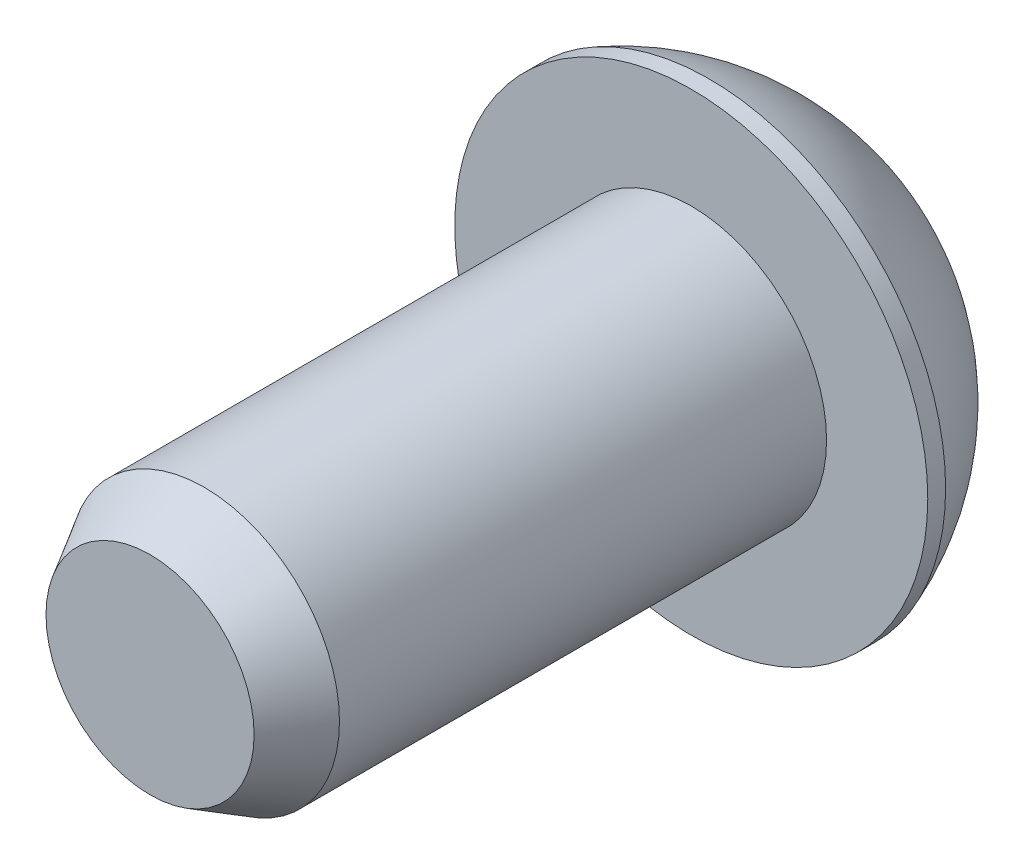
ISO-10303-21;
HEADER;
FILE_DESCRIPTION(('STEP AP214'),'2;1');
FILE_NAME('part.step','',(''),(''),'','','');
FILE_SCHEMA(('AUTOMOTIVE_DESIGN { 1 0 10303 214 1 1 1 1 }'));
ENDSEC;
DATA;
#1=APPLICATION_CONTEXT('core data for automotive mechanical design processes');
#2=APPLICATION_PROTOCOL_DEFINITION('international standard','automotive_design',2000,#1);
#3=PRODUCT_CONTEXT('',#1,'mechanical');
#4=PRODUCT('Part','Part','',(#3));
#5=PRODUCT_RELATED_PRODUCT_CATEGORY('part','',(#4));
#6=PRODUCT_DEFINITION_FORMATION('','',#4);
#7=PRODUCT_DEFINITION_CONTEXT('part definition',#1,'design');
#8=PRODUCT_DEFINITION('design','',#6,#7);
#9=PRODUCT_DEFINITION_SHAPE('','',#8);
#10=(LENGTH_UNIT() NAMED_UNIT(*) SI_UNIT(.MILLI.,.METRE.));
#11=(NAMED_UNIT(*) PLANE_ANGLE_UNIT() SI_UNIT($,.RADIAN.));
#12=(NAMED_UNIT(*) SI_UNIT($,.STERADIAN.) SOLID_ANGLE_UNIT());
#13=UNCERTAINTY_MEASURE_WITH_UNIT(LENGTH_MEASURE(1.E-05),#10,'distance_accuracy_value','');
#14=(GEOMETRIC_REPRESENTATION_CONTEXT(3) GLOBAL_UNCERTAINTY_ASSIGNED_CONTEXT((#13)) GLOBAL_UNIT_ASSIGNED_CONTEXT((#10,
#11,#12)) REPRESENTATION_CONTEXT('',''));
#15=CARTESIAN_POINT('',(0.,0.,0.));
#16=DIRECTION('',(0.,0.,1.));
#17=DIRECTION('',(1.,0.,0.));
#18=AXIS2_PLACEMENT_3D('',#15,#16,#17);
#19=CARTESIAN_POINT('',(5.54989996262456,0.,3.35279999999999));
#20=DIRECTION('',(0.,0.,1.));
#21=DIRECTION('',(1.,0.,0.));
#22=AXIS2_PLACEMENT_3D('',#19,#20,#21);
#23=PLANE('',#22);
#24=CARTESIAN_POINT('',(-1.63057978577741E-08,0.,3.35279999999999));
#25=DIRECTION('',(0.,0.,1.));
#26=DIRECTION('',(1.,0.,0.));
#27=AXIS2_PLACEMENT_3D('',#24,#25,#26);
#28=CIRCLE('',#27,5.54989997893035);
#29=CARTESIAN_POINT('',(5.54989996262456,0.,3.35279999999999));
#30=VERTEX_POINT('',#29);
#31=EDGE_CURVE('E145',#30,#30,#28,.T.);
#32=ORIENTED_EDGE('',*,*,#31,.T.);
#33=EDGE_LOOP('',(#32));
#34=FACE_BOUND('',#33,.T.);
#35=CARTESIAN_POINT('',(0.,0.,3.35279999999999));
#36=DIRECTION('',(0.,0.,1.));
#37=DIRECTION('',(1.,0.,0.));
#38=AXIS2_PLACEMENT_3D('',#35,#36,#37);
#39=CIRCLE('',#38,3.175);
#40=CARTESIAN_POINT('',(3.175,0.,3.35279999999999));
#41=VERTEX_POINT('',#40);
#42=EDGE_CURVE('E124',#41,#41,#39,.T.);
#43=ORIENTED_EDGE('',*,*,#42,.F.);
#44=EDGE_LOOP('',(#43));
#45=FACE_BOUND('',#44,.T.);
#46=ADVANCED_FACE('F34',(#34,#45),#23,.T.);
#47=CARTESIAN_POINT('',(-2.10696915643738E-08,0.,4.99835714285725));
#48=DIRECTION('',(0.,0.,1.));
#49=DIRECTION('',(1.,0.,0.));
#50=AXIS2_PLACEMENT_3D('',#47,#48,#49);
#51=SPHERICAL_SURFACE('',#50,5.92150311760007);
#52=CARTESIAN_POINT('',(-1.63057978577741E-08,0.,0.));
#53=DIRECTION('',(0.,0.,1.));
#54=DIRECTION('',(1.,0.,0.));
#55=AXIS2_PLACEMENT_3D('',#52,#53,#54);
#56=CIRCLE('',#55,3.17500000219601);
#57=CARTESIAN_POINT('',(3.17499998589021,0.,0.));
#58=VERTEX_POINT('',#57);
#59=EDGE_CURVE('E148',#58,#58,#56,.T.);
#60=ORIENTED_EDGE('',*,*,#59,.T.);
#61=EDGE_LOOP('',(#60));
#62=FACE_BOUND('',#61,.T.);
#63=CARTESIAN_POINT('',(-1.63057978577741E-08,0.,2.93369994546637));
#64=DIRECTION('',(0.,0.,1.));
#65=DIRECTION('',(1.,0.,0.));
#66=AXIS2_PLACEMENT_3D('',#63,#64,#65);
#67=CIRCLE('',#66,5.54989997893035);
#68=CARTESIAN_POINT('',(5.54989996262456,0.,2.93369994546637));
#69=VERTEX_POINT('',#68);
#70=EDGE_CURVE('E137',#69,#69,#67,.T.);
#71=ORIENTED_EDGE('',*,*,#70,.F.);
#72=EDGE_LOOP('',(#71));
#73=FACE_BOUND('',#72,.T.);
#74=ADVANCED_FACE('F164',(#62,#73),#51,.T.);
#75=CARTESIAN_POINT('',(-1.63057978577741E-08,0.,0.));
#76=DIRECTION('',(0.,0.,-1.));
#77=DIRECTION('',(-1.,0.,0.));
#78=AXIS2_PLACEMENT_3D('',#75,#76,#77);
#79=PLANE('',#78);
#80=DIRECTION('',(-0.5,0.866025403784439,0.));
#81=VECTOR('',#80,1.);
#82=CARTESIAN_POINT('',(-1.14567944042316,-1.984375,0.));
#83=LINE('',#82,#81);
#84=CARTESIAN_POINT('',(-1.14567944042316,-1.984375,0.));
#85=VERTEX_POINT('',#84);
#86=CARTESIAN_POINT('',(-2.29135888084633,0.,0.));
#87=VERTEX_POINT('',#86);
#88=EDGE_CURVE('E49',#85,#87,#83,.T.);
#89=ORIENTED_EDGE('',*,*,#88,.F.);
#90=DIRECTION('',(-1.,0.,0.));
#91=VECTOR('',#90,1.);
#92=CARTESIAN_POINT('',(1.14567944042316,-1.984375,0.));
#93=LINE('',#92,#91);
#94=CARTESIAN_POINT('',(1.14567944042316,-1.984375,0.));
#95=VERTEX_POINT('',#94);
#96=EDGE_CURVE('E133',#95,#85,#93,.T.);
#97=ORIENTED_EDGE('',*,*,#96,.F.);
#98=DIRECTION('',(-0.5,-0.866025403784438,0.));
#99=VECTOR('',#98,1.);
#100=CARTESIAN_POINT('',(2.29135888084633,0.,0.));
#101=LINE('',#100,#99);
#102=CARTESIAN_POINT('',(2.29135888084633,0.,0.));
#103=VERTEX_POINT('',#102);
#104=EDGE_CURVE('E131',#103,#95,#101,.T.);
#105=ORIENTED_EDGE('',*,*,#104,.F.);
#106=DIRECTION('',(0.5,-0.866025403784439,0.));
#107=VECTOR('',#106,1.);
#108=CARTESIAN_POINT('',(1.14567944042317,1.984375,0.));
#109=LINE('',#108,#107);
#110=CARTESIAN_POINT('',(1.14567944042317,1.984375,0.));
#111=VERTEX_POINT('',#110);
#112=EDGE_CURVE('E97',#111,#103,#109,.T.);
#113=ORIENTED_EDGE('',*,*,#112,.F.);
#114=DIRECTION('',(1.,0.,0.));
#115=VECTOR('',#114,1.);
#116=CARTESIAN_POINT('',(-1.14567944042316,1.984375,0.));
#117=LINE('',#116,#115);
#118=CARTESIAN_POINT('',(-1.14567944042316,1.984375,0.));
#119=VERTEX_POINT('',#118);
#120=EDGE_CURVE('E127',#119,#111,#117,.T.);
#121=ORIENTED_EDGE('',*,*,#120,.F.);
#122=DIRECTION('',(0.5,0.866025403784439,0.));
#123=VECTOR('',#122,1.);
#124=CARTESIAN_POINT('',(-2.29135888084633,0.,0.));
#125=LINE('',#124,#123);
#126=EDGE_CURVE('E123',#87,#119,#125,.T.);
#127=ORIENTED_EDGE('',*,*,#126,.F.);
#128=EDGE_LOOP('',(#89,#97,#105,#113,#121,#127));
#129=FACE_BOUND('',#128,.T.);
#130=ORIENTED_EDGE('',*,*,#59,.F.);
#131=EDGE_LOOP('',(#130));
#132=FACE_BOUND('',#131,.T.);
#133=ADVANCED_FACE('F170',(#129,#132),#79,.T.);
#134=CARTESIAN_POINT('',(-1.63057978577741E-08,0.,0.));
#135=DIRECTION('',(0.,0.,1.));
#136=DIRECTION('',(1.,0.,0.));
#137=AXIS2_PLACEMENT_3D('',#134,#135,#136);
#138=CYLINDRICAL_SURFACE('',#137,5.54989997893035);
#139=ORIENTED_EDGE('',*,*,#70,.T.);
#140=EDGE_LOOP('',(#139));
#141=FACE_BOUND('',#140,.T.);
#142=ORIENTED_EDGE('',*,*,#31,.F.);
#143=EDGE_LOOP('',(#142));
#144=FACE_BOUND('',#143,.T.);
#145=ADVANCED_FACE('F175',(#141,#144),#138,.T.);
#146=CARTESIAN_POINT('',(-1.14567944042316,-1.984375,2.2225));
#147=DIRECTION('',(-0.866025403784439,-0.5,0.));
#148=DIRECTION('',(0.5,-0.866025403784439,0.));
#149=AXIS2_PLACEMENT_3D('',#146,#147,#148);
#150=PLANE('',#149);
#151=ORIENTED_EDGE('',*,*,#88,.T.);
#152=DIRECTION('',(0.,0.,-1.));
#153=VECTOR('',#152,1.);
#154=CARTESIAN_POINT('',(-2.29135888084633,0.,2.2225));
#155=LINE('',#154,#153);
#156=CARTESIAN_POINT('',(-2.29135888084633,0.,2.2225));
#157=VERTEX_POINT('',#156);
#158=EDGE_CURVE('E79',#157,#87,#155,.T.);
#159=ORIENTED_EDGE('',*,*,#158,.F.);
#160=DIRECTION('',(-0.5,0.866025403784439,0.));
#161=VECTOR('',#160,1.);
#162=CARTESIAN_POINT('',(-1.14567944042316,-1.984375,2.2225));
#163=LINE('',#162,#161);
#164=CARTESIAN_POINT('',(-1.14567944042316,-1.984375,2.2225));
#165=VERTEX_POINT('',#164);
#166=EDGE_CURVE('E135',#165,#157,#163,.T.);
#167=ORIENTED_EDGE('',*,*,#166,.F.);
#168=DIRECTION('',(0.,0.,-1.));
#169=VECTOR('',#168,1.);
#170=CARTESIAN_POINT('',(-1.14567944042316,-1.984375,2.2225));
#171=LINE('',#170,#169);
#172=EDGE_CURVE('E57',#165,#85,#171,.T.);
#173=ORIENTED_EDGE('',*,*,#172,.T.);
#174=EDGE_LOOP('',(#151,#159,#167,#173));
#175=FACE_BOUND('',#174,.T.);
#176=ADVANCED_FACE('F182',(#175),#150,.F.);
#177=CARTESIAN_POINT('',(1.14567944042316,-1.984375,2.2225));
#178=DIRECTION('',(0.,-1.,0.));
#179=DIRECTION('',(1.,0.,0.));
#180=AXIS2_PLACEMENT_3D('',#177,#178,#179);
#181=PLANE('',#180);
#182=ORIENTED_EDGE('',*,*,#96,.T.);
#183=ORIENTED_EDGE('',*,*,#172,.F.);
#184=DIRECTION('',(-1.,0.,0.));
#185=VECTOR('',#184,1.);
#186=CARTESIAN_POINT('',(1.14567944042316,-1.984375,2.2225));
#187=LINE('',#186,#185);
#188=CARTESIAN_POINT('',(1.14567944042316,-1.984375,2.2225));
#189=VERTEX_POINT('',#188);
#190=EDGE_CURVE('E109',#189,#165,#187,.T.);
#191=ORIENTED_EDGE('',*,*,#190,.F.);
#192=DIRECTION('',(0.,0.,-1.));
#193=VECTOR('',#192,1.);
#194=CARTESIAN_POINT('',(1.14567944042316,-1.984375,2.2225));
#195=LINE('',#194,#193);
#196=EDGE_CURVE('E101',#189,#95,#195,.T.);
#197=ORIENTED_EDGE('',*,*,#196,.T.);
#198=EDGE_LOOP('',(#182,#183,#191,#197));
#199=FACE_BOUND('',#198,.T.);
#200=ADVANCED_FACE('F208',(#199),#181,.F.);
#201=CARTESIAN_POINT('',(2.29135888084633,0.,2.2225));
#202=DIRECTION('',(0.866025403784438,-0.5,0.));
#203=DIRECTION('',(0.5,0.866025403784439,0.));
#204=AXIS2_PLACEMENT_3D('',#201,#202,#203);
#205=PLANE('',#204);
#206=ORIENTED_EDGE('',*,*,#104,.T.);
#207=ORIENTED_EDGE('',*,*,#196,.F.);
#208=DIRECTION('',(-0.5,-0.866025403784438,0.));
#209=VECTOR('',#208,1.);
#210=CARTESIAN_POINT('',(2.29135888084633,0.,2.2225));
#211=LINE('',#210,#209);
#212=CARTESIAN_POINT('',(2.29135888084633,0.,2.2225));
#213=VERTEX_POINT('',#212);
#214=EDGE_CURVE('E105',#213,#189,#211,.T.);
#215=ORIENTED_EDGE('',*,*,#214,.F.);
#216=DIRECTION('',(0.,0.,-1.));
#217=VECTOR('',#216,1.);
#218=CARTESIAN_POINT('',(2.29135888084633,0.,2.2225));
#219=LINE('',#218,#217);
#220=EDGE_CURVE('E90',#213,#103,#219,.T.);
#221=ORIENTED_EDGE('',*,*,#220,.T.);
#222=EDGE_LOOP('',(#206,#207,#215,#221));
#223=FACE_BOUND('',#222,.T.);
#224=ADVANCED_FACE('F106',(#223),#205,.F.);
#225=CARTESIAN_POINT('',(1.14567944042317,1.984375,2.2225));
#226=DIRECTION('',(0.866025403784439,0.5,0.));
#227=DIRECTION('',(-0.5,0.866025403784439,0.));
#228=AXIS2_PLACEMENT_3D('',#225,#226,#227);
#229=PLANE('',#228);
#230=ORIENTED_EDGE('',*,*,#112,.T.);
#231=ORIENTED_EDGE('',*,*,#220,.F.);
#232=DIRECTION('',(0.5,-0.866025403784439,0.));
#233=VECTOR('',#232,1.);
#234=CARTESIAN_POINT('',(1.14567944042317,1.984375,2.2225));
#235=LINE('',#234,#233);
#236=CARTESIAN_POINT('',(1.14567944042317,1.984375,2.2225));
#237=VERTEX_POINT('',#236);
#238=EDGE_CURVE('E94',#237,#213,#235,.T.);
#239=ORIENTED_EDGE('',*,*,#238,.F.);
#240=DIRECTION('',(0.,0.,-1.));
#241=VECTOR('',#240,1.);
#242=CARTESIAN_POINT('',(1.14567944042317,1.984375,2.2225));
#243=LINE('',#242,#241);
#244=EDGE_CURVE('E102',#237,#111,#243,.T.);
#245=ORIENTED_EDGE('',*,*,#244,.T.);
#246=EDGE_LOOP('',(#230,#231,#239,#245));
#247=FACE_BOUND('',#246,.T.);
#248=ADVANCED_FACE('F92',(#247),#229,.F.);
#249=CARTESIAN_POINT('',(-1.14567944042316,1.984375,2.2225));
#250=DIRECTION('',(0.,1.,0.));
#251=DIRECTION('',(-1.,0.,0.));
#252=AXIS2_PLACEMENT_3D('',#249,#250,#251);
#253=PLANE('',#252);
#254=ORIENTED_EDGE('',*,*,#120,.T.);
#255=ORIENTED_EDGE('',*,*,#244,.F.);
#256=DIRECTION('',(1.,0.,0.));
#257=VECTOR('',#256,1.);
#258=CARTESIAN_POINT('',(-1.14567944042316,1.984375,2.2225));
#259=LINE('',#258,#257);
#260=CARTESIAN_POINT('',(-1.14567944042316,1.984375,2.2225));
#261=VERTEX_POINT('',#260);
#262=EDGE_CURVE('E115',#261,#237,#259,.T.);
#263=ORIENTED_EDGE('',*,*,#262,.F.);
#264=DIRECTION('',(0.,0.,-1.));
#265=VECTOR('',#264,1.);
#266=CARTESIAN_POINT('',(-1.14567944042316,1.984375,2.2225));
#267=LINE('',#266,#265);
#268=EDGE_CURVE('E140',#261,#119,#267,.T.);
#269=ORIENTED_EDGE('',*,*,#268,.T.);
#270=EDGE_LOOP('',(#254,#255,#263,#269));
#271=FACE_BOUND('',#270,.T.);
#272=ADVANCED_FACE('F215',(#271),#253,.F.);
#273=CARTESIAN_POINT('',(-2.29135888084633,0.,2.2225));
#274=DIRECTION('',(-0.866025403784439,0.5,0.));
#275=DIRECTION('',(-0.5,-0.866025403784439,0.));
#276=AXIS2_PLACEMENT_3D('',#273,#274,#275);
#277=PLANE('',#276);
#278=ORIENTED_EDGE('',*,*,#126,.T.);
#279=ORIENTED_EDGE('',*,*,#268,.F.);
#280=DIRECTION('',(0.5,0.866025403784439,0.));
#281=VECTOR('',#280,1.);
#282=CARTESIAN_POINT('',(-2.29135888084633,0.,2.2225));
#283=LINE('',#282,#281);
#284=EDGE_CURVE('E117',#157,#261,#283,.T.);
#285=ORIENTED_EDGE('',*,*,#284,.F.);
#286=ORIENTED_EDGE('',*,*,#158,.T.);
#287=EDGE_LOOP('',(#278,#279,#285,#286));
#288=FACE_BOUND('',#287,.T.);
#289=ADVANCED_FACE('F194',(#288),#277,.F.);
#290=CARTESIAN_POINT('',(-2.29135888084633,0.,2.2225));
#291=DIRECTION('',(0.,0.,-1.));
#292=DIRECTION('',(-1.,0.,0.));
#293=AXIS2_PLACEMENT_3D('',#290,#291,#292);
#294=PLANE('',#293);
#295=ORIENTED_EDGE('',*,*,#166,.T.);
#296=ORIENTED_EDGE('',*,*,#284,.T.);
#297=ORIENTED_EDGE('',*,*,#262,.T.);
#298=ORIENTED_EDGE('',*,*,#238,.T.);
#299=ORIENTED_EDGE('',*,*,#214,.T.);
#300=ORIENTED_EDGE('',*,*,#190,.T.);
#301=EDGE_LOOP('',(#295,#296,#297,#298,#299,#300));
#302=FACE_BOUND('',#301,.T.);
#303=ADVANCED_FACE('F112',(#302),#294,.T.);
#304=CARTESIAN_POINT('',(0.,0.,16.0528));
#305=DIRECTION('',(0.,0.,-1.));
#306=DIRECTION('',(-1.,0.,0.));
#307=AXIS2_PLACEMENT_3D('',#304,#305,#306);
#308=CYLINDRICAL_SURFACE('',#307,3.175);
#309=CARTESIAN_POINT('',(0.,0.,14.7828));
#310=DIRECTION('',(0.,0.,1.));
#311=DIRECTION('',(1.,0.,0.));
#312=AXIS2_PLACEMENT_3D('',#309,#310,#311);
#313=CIRCLE('',#312,3.175);
#314=CARTESIAN_POINT('',(3.175,0.,14.7828));
#315=VERTEX_POINT('',#314);
#316=EDGE_CURVE('E11',#315,#315,#313,.F.);
#317=ORIENTED_EDGE('',*,*,#316,.T.);
#318=EDGE_LOOP('',(#317));
#319=FACE_BOUND('',#318,.T.);
#320=ORIENTED_EDGE('',*,*,#42,.T.);
#321=EDGE_LOOP('',(#320));
#322=FACE_BOUND('',#321,.T.);
#323=ADVANCED_FACE('F160',(#319,#322),#308,.T.);
#324=CARTESIAN_POINT('',(0.,0.,16.0528));
#325=DIRECTION('',(0.,0.,1.));
#326=DIRECTION('',(1.,0.,0.));
#327=AXIS2_PLACEMENT_3D('',#324,#325,#326);
#328=PLANE('',#327);
#329=CARTESIAN_POINT('',(0.,0.,16.0528));
#330=DIRECTION('',(0.,0.,1.));
#331=DIRECTION('',(1.,0.,0.));
#332=AXIS2_PLACEMENT_3D('',#329,#330,#331);
#333=CIRCLE('',#332,2.44176515812917);
#334=CARTESIAN_POINT('',(2.44176515812917,0.,16.0528));
#335=VERTEX_POINT('',#334);
#336=EDGE_CURVE('E42',#335,#335,#333,.T.);
#337=ORIENTED_EDGE('',*,*,#336,.T.);
#338=EDGE_LOOP('',(#337));
#339=FACE_BOUND('',#338,.T.);
#340=ADVANCED_FACE('F153',(#339),#328,.T.);
#341=CARTESIAN_POINT('',(0.,0.,16.0528));
#342=DIRECTION('',(0.,0.,-1.));
#343=DIRECTION('',(-1.,0.,0.));
#344=AXIS2_PLACEMENT_3D('',#341,#342,#343);
#345=CONICAL_SURFACE('',#344,2.44176515812917,0.523598775598296);
#346=ORIENTED_EDGE('',*,*,#316,.F.);
#347=EDGE_LOOP('',(#346));
#348=FACE_BOUND('',#347,.T.);
#349=ORIENTED_EDGE('',*,*,#336,.F.);
#350=EDGE_LOOP('',(#349));
#351=FACE_BOUND('',#350,.T.);
#352=ADVANCED_FACE('F36',(#348,#351),#345,.T.);
#353=CLOSED_SHELL('',(#46,#74,#133,#145,#176,#200,#224,#248,#272,#289,#303,#323,#340,#352));
#354=MANIFOLD_SOLID_BREP('B2',#353);
#355=ADVANCED_BREP_SHAPE_REPRESENTATION('',(#18,#354),#14);
#356=SHAPE_DEFINITION_REPRESENTATION(#9,#355);
ENDSEC;
END-ISO-10303-21;
